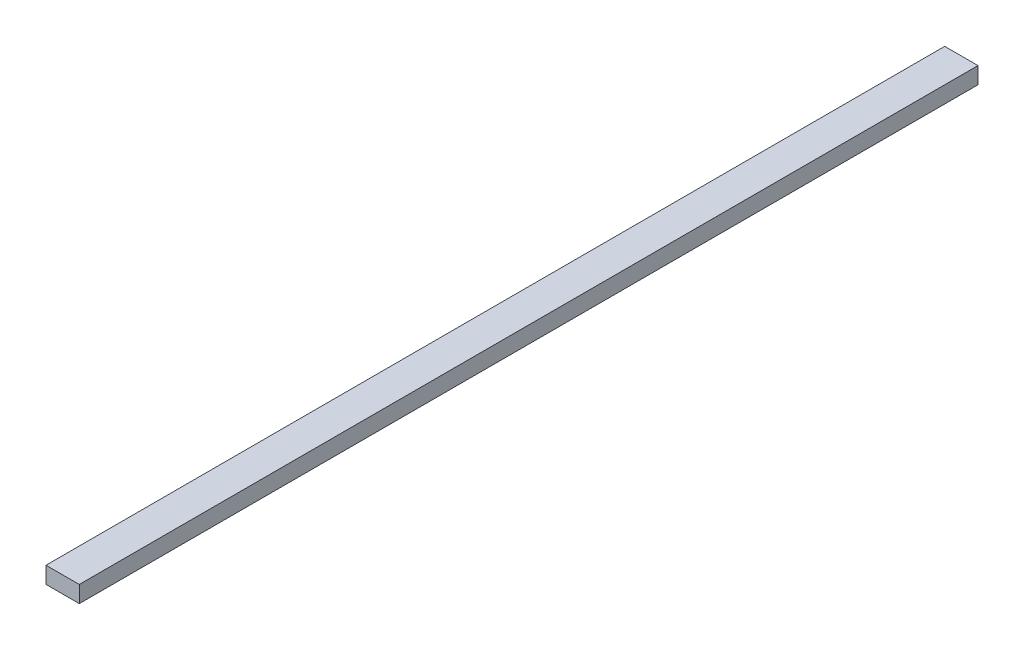
ISO-10303-21;
HEADER;
FILE_DESCRIPTION(('STEP AP214'),'2;1');
FILE_NAME('part.step','',(''),(''),'','','');
FILE_SCHEMA(('AUTOMOTIVE_DESIGN { 1 0 10303 214 1 1 1 1 }'));
ENDSEC;
DATA;
#1=APPLICATION_CONTEXT('core data for automotive mechanical design processes');
#2=APPLICATION_PROTOCOL_DEFINITION('international standard','automotive_design',2000,#1);
#3=PRODUCT_CONTEXT('',#1,'mechanical');
#4=PRODUCT('Part','Part','',(#3));
#5=PRODUCT_RELATED_PRODUCT_CATEGORY('part','',(#4));
#6=PRODUCT_DEFINITION_FORMATION('','',#4);
#7=PRODUCT_DEFINITION_CONTEXT('part definition',#1,'design');
#8=PRODUCT_DEFINITION('design','',#6,#7);
#9=PRODUCT_DEFINITION_SHAPE('','',#8);
#10=(LENGTH_UNIT() NAMED_UNIT(*) SI_UNIT(.MILLI.,.METRE.));
#11=(NAMED_UNIT(*) PLANE_ANGLE_UNIT() SI_UNIT($,.RADIAN.));
#12=(NAMED_UNIT(*) SI_UNIT($,.STERADIAN.) SOLID_ANGLE_UNIT());
#13=UNCERTAINTY_MEASURE_WITH_UNIT(LENGTH_MEASURE(1.E-05),#10,'distance_accuracy_value','');
#14=(GEOMETRIC_REPRESENTATION_CONTEXT(3) GLOBAL_UNCERTAINTY_ASSIGNED_CONTEXT((#13)) GLOBAL_UNIT_ASSIGNED_CONTEXT((#10,
#11,#12)) REPRESENTATION_CONTEXT('',''));
#15=CARTESIAN_POINT('',(0.,0.,0.));
#16=DIRECTION('',(0.,0.,1.));
#17=DIRECTION('',(1.,0.,0.));
#18=AXIS2_PLACEMENT_3D('',#15,#16,#17);
#19=CARTESIAN_POINT('',(0.,50.8,2743.2));
#20=DIRECTION('',(1.,0.,0.));
#21=DIRECTION('',(0.,1.,0.));
#22=AXIS2_PLACEMENT_3D('',#19,#20,#21);
#23=PLANE('',#22);
#24=DIRECTION('',(0.,-1.,0.));
#25=VECTOR('',#24,1.);
#26=CARTESIAN_POINT('',(0.,50.8,0.));
#27=LINE('',#26,#25);
#28=CARTESIAN_POINT('',(0.,50.8,0.));
#29=VERTEX_POINT('',#28);
#30=CARTESIAN_POINT('',(0.,0.,0.));
#31=VERTEX_POINT('',#30);
#32=EDGE_CURVE('E96',#29,#31,#27,.T.);
#33=ORIENTED_EDGE('',*,*,#32,.T.);
#34=DIRECTION('',(0.,0.,-1.));
#35=VECTOR('',#34,1.);
#36=CARTESIAN_POINT('',(0.,0.,2743.2));
#37=LINE('',#36,#35);
#38=CARTESIAN_POINT('',(0.,0.,2743.2));
#39=VERTEX_POINT('',#38);
#40=EDGE_CURVE('E11',#39,#31,#37,.T.);
#41=ORIENTED_EDGE('',*,*,#40,.F.);
#42=DIRECTION('',(0.,-1.,0.));
#43=VECTOR('',#42,1.);
#44=CARTESIAN_POINT('',(0.,50.8,2743.2));
#45=LINE('',#44,#43);
#46=CARTESIAN_POINT('',(0.,50.8,2743.2));
#47=VERTEX_POINT('',#46);
#48=EDGE_CURVE('E84',#47,#39,#45,.T.);
#49=ORIENTED_EDGE('',*,*,#48,.F.);
#50=DIRECTION('',(0.,0.,-1.));
#51=VECTOR('',#50,1.);
#52=CARTESIAN_POINT('',(0.,50.8,2743.2));
#53=LINE('',#52,#51);
#54=EDGE_CURVE('E92',#47,#29,#53,.T.);
#55=ORIENTED_EDGE('',*,*,#54,.T.);
#56=EDGE_LOOP('',(#33,#41,#49,#55));
#57=FACE_BOUND('',#56,.T.);
#58=ADVANCED_FACE('F33',(#57),#23,.F.);
#59=CARTESIAN_POINT('',(0.,0.,2743.2));
#60=DIRECTION('',(0.,1.,0.));
#61=DIRECTION('',(0.,0.,1.));
#62=AXIS2_PLACEMENT_3D('',#59,#60,#61);
#63=PLANE('',#62);
#64=DIRECTION('',(1.,0.,0.));
#65=VECTOR('',#64,1.);
#66=CARTESIAN_POINT('',(0.,0.,0.));
#67=LINE('',#66,#65);
#68=CARTESIAN_POINT('',(101.6,0.,0.));
#69=VERTEX_POINT('',#68);
#70=EDGE_CURVE('E88',#31,#69,#67,.T.);
#71=ORIENTED_EDGE('',*,*,#70,.T.);
#72=DIRECTION('',(0.,0.,-1.));
#73=VECTOR('',#72,1.);
#74=CARTESIAN_POINT('',(101.6,0.,2743.2));
#75=LINE('',#74,#73);
#76=CARTESIAN_POINT('',(101.6,0.,2743.2));
#77=VERTEX_POINT('',#76);
#78=EDGE_CURVE('E41',#77,#69,#75,.T.);
#79=ORIENTED_EDGE('',*,*,#78,.F.);
#80=DIRECTION('',(1.,0.,0.));
#81=VECTOR('',#80,1.);
#82=CARTESIAN_POINT('',(0.,0.,2743.2));
#83=LINE('',#82,#81);
#84=EDGE_CURVE('E79',#39,#77,#83,.T.);
#85=ORIENTED_EDGE('',*,*,#84,.F.);
#86=ORIENTED_EDGE('',*,*,#40,.T.);
#87=EDGE_LOOP('',(#71,#79,#85,#86));
#88=FACE_BOUND('',#87,.T.);
#89=ADVANCED_FACE('F87',(#88),#63,.F.);
#90=CARTESIAN_POINT('',(101.6,0.,2743.2));
#91=DIRECTION('',(-1.,0.,0.));
#92=DIRECTION('',(0.,0.,1.));
#93=AXIS2_PLACEMENT_3D('',#90,#91,#92);
#94=PLANE('',#93);
#95=DIRECTION('',(0.,1.,0.));
#96=VECTOR('',#95,1.);
#97=CARTESIAN_POINT('',(101.6,0.,0.));
#98=LINE('',#97,#96);
#99=CARTESIAN_POINT('',(101.6,50.8,0.));
#100=VERTEX_POINT('',#99);
#101=EDGE_CURVE('E66',#69,#100,#98,.T.);
#102=ORIENTED_EDGE('',*,*,#101,.T.);
#103=DIRECTION('',(0.,0.,-1.));
#104=VECTOR('',#103,1.);
#105=CARTESIAN_POINT('',(101.6,50.8,2743.2));
#106=LINE('',#105,#104);
#107=CARTESIAN_POINT('',(101.6,50.8,2743.2));
#108=VERTEX_POINT('',#107);
#109=EDGE_CURVE('E89',#108,#100,#106,.T.);
#110=ORIENTED_EDGE('',*,*,#109,.F.);
#111=DIRECTION('',(0.,1.,0.));
#112=VECTOR('',#111,1.);
#113=CARTESIAN_POINT('',(101.6,0.,2743.2));
#114=LINE('',#113,#112);
#115=EDGE_CURVE('E82',#77,#108,#114,.T.);
#116=ORIENTED_EDGE('',*,*,#115,.F.);
#117=ORIENTED_EDGE('',*,*,#78,.T.);
#118=EDGE_LOOP('',(#102,#110,#116,#117));
#119=FACE_BOUND('',#118,.T.);
#120=ADVANCED_FACE('F90',(#119),#94,.F.);
#121=CARTESIAN_POINT('',(101.6,50.8,2743.2));
#122=DIRECTION('',(0.,-1.,0.));
#123=DIRECTION('',(1.,0.,0.));
#124=AXIS2_PLACEMENT_3D('',#121,#122,#123);
#125=PLANE('',#124);
#126=DIRECTION('',(-1.,0.,0.));
#127=VECTOR('',#126,1.);
#128=CARTESIAN_POINT('',(101.6,50.8,0.));
#129=LINE('',#128,#127);
#130=EDGE_CURVE('E72',#100,#29,#129,.T.);
#131=ORIENTED_EDGE('',*,*,#130,.T.);
#132=ORIENTED_EDGE('',*,*,#54,.F.);
#133=DIRECTION('',(-1.,0.,0.));
#134=VECTOR('',#133,1.);
#135=CARTESIAN_POINT('',(101.6,50.8,2743.2));
#136=LINE('',#135,#134);
#137=EDGE_CURVE('E49',#108,#47,#136,.T.);
#138=ORIENTED_EDGE('',*,*,#137,.F.);
#139=ORIENTED_EDGE('',*,*,#109,.T.);
#140=EDGE_LOOP('',(#131,#132,#138,#139));
#141=FACE_BOUND('',#140,.T.);
#142=ADVANCED_FACE('F103',(#141),#125,.F.);
#143=CARTESIAN_POINT('',(0.,0.,2743.2));
#144=DIRECTION('',(0.,0.,1.));
#145=DIRECTION('',(1.,0.,0.));
#146=AXIS2_PLACEMENT_3D('',#143,#144,#145);
#147=PLANE('',#146);
#148=ORIENTED_EDGE('',*,*,#48,.T.);
#149=ORIENTED_EDGE('',*,*,#84,.T.);
#150=ORIENTED_EDGE('',*,*,#115,.T.);
#151=ORIENTED_EDGE('',*,*,#137,.T.);
#152=EDGE_LOOP('',(#148,#149,#150,#151));
#153=FACE_BOUND('',#152,.T.);
#154=ADVANCED_FACE('F80',(#153),#147,.T.);
#155=CARTESIAN_POINT('',(0.,0.,0.));
#156=DIRECTION('',(0.,0.,1.));
#157=DIRECTION('',(1.,0.,0.));
#158=AXIS2_PLACEMENT_3D('',#155,#156,#157);
#159=PLANE('',#158);
#160=ORIENTED_EDGE('',*,*,#32,.F.);
#161=ORIENTED_EDGE('',*,*,#130,.F.);
#162=ORIENTED_EDGE('',*,*,#101,.F.);
#163=ORIENTED_EDGE('',*,*,#70,.F.);
#164=EDGE_LOOP('',(#160,#161,#162,#163));
#165=FACE_BOUND('',#164,.T.);
#166=ADVANCED_FACE('F106',(#165),#159,.F.);
#167=CLOSED_SHELL('',(#58,#89,#120,#142,#154,#166));
#168=MANIFOLD_SOLID_BREP('B2',#167);
#169=ADVANCED_BREP_SHAPE_REPRESENTATION('',(#18,#168),#14);
#170=SHAPE_DEFINITION_REPRESENTATION(#9,#169);
ENDSEC;
END-ISO-10303-21;
